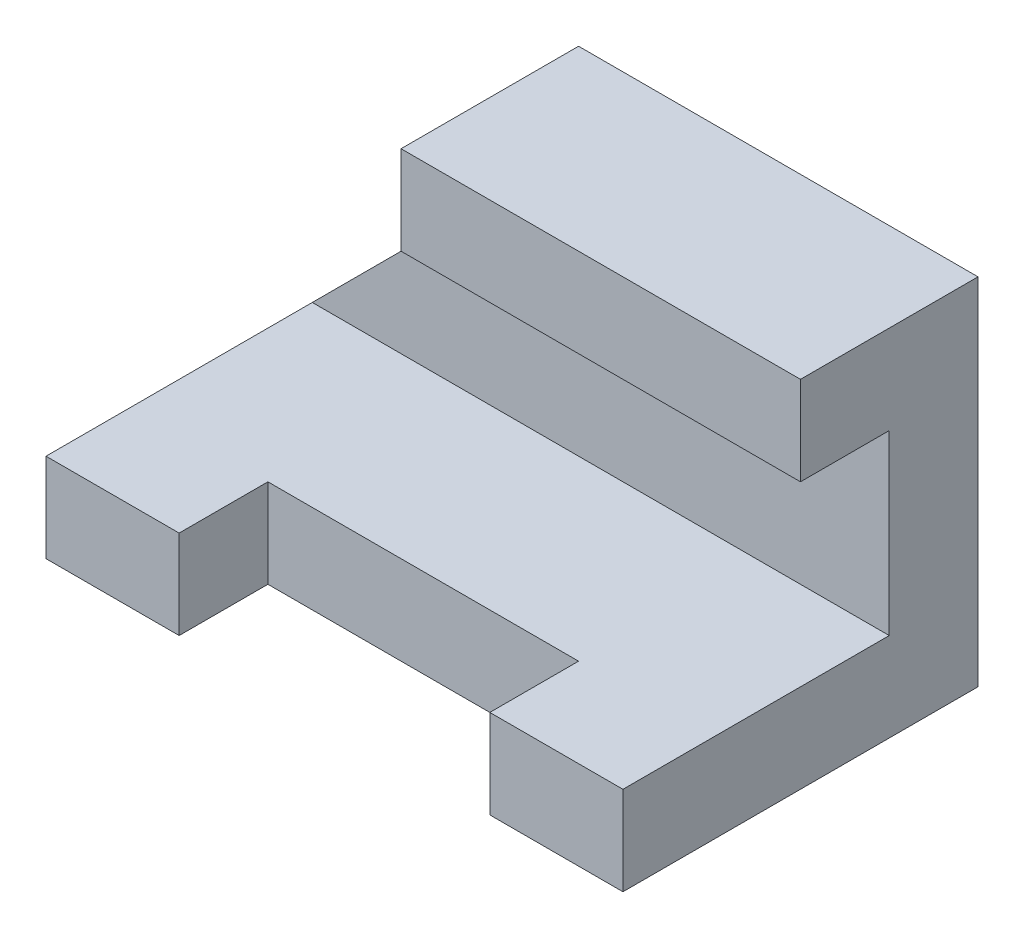
ISO-10303-21;
HEADER;
FILE_DESCRIPTION(('STEP AP214'),'2;1');
FILE_NAME('part.step','',(''),(''),'','','');
FILE_SCHEMA(('AUTOMOTIVE_DESIGN { 1 0 10303 214 1 1 1 1 }'));
ENDSEC;
DATA;
#1=APPLICATION_CONTEXT('core data for automotive mechanical design processes');
#2=APPLICATION_PROTOCOL_DEFINITION('international standard','automotive_design',2000,#1);
#3=PRODUCT_CONTEXT('',#1,'mechanical');
#4=PRODUCT('Part','Part','',(#3));
#5=PRODUCT_RELATED_PRODUCT_CATEGORY('part','',(#4));
#6=PRODUCT_DEFINITION_FORMATION('','',#4);
#7=PRODUCT_DEFINITION_CONTEXT('part definition',#1,'design');
#8=PRODUCT_DEFINITION('design','',#6,#7);
#9=PRODUCT_DEFINITION_SHAPE('','',#8);
#10=(LENGTH_UNIT() NAMED_UNIT(*) SI_UNIT(.MILLI.,.METRE.));
#11=(NAMED_UNIT(*) PLANE_ANGLE_UNIT() SI_UNIT($,.RADIAN.));
#12=(NAMED_UNIT(*) SI_UNIT($,.STERADIAN.) SOLID_ANGLE_UNIT());
#13=UNCERTAINTY_MEASURE_WITH_UNIT(LENGTH_MEASURE(1.E-05),#10,'distance_accuracy_value','');
#14=(GEOMETRIC_REPRESENTATION_CONTEXT(3) GLOBAL_UNCERTAINTY_ASSIGNED_CONTEXT((#13)) GLOBAL_UNIT_ASSIGNED_CONTEXT((#10,
#11,#12)) REPRESENTATION_CONTEXT('',''));
#15=CARTESIAN_POINT('',(0.,0.,0.));
#16=DIRECTION('',(0.,0.,1.));
#17=DIRECTION('',(1.,0.,0.));
#18=AXIS2_PLACEMENT_3D('',#15,#16,#17);
#19=CARTESIAN_POINT('',(0.,0.,8.));
#20=DIRECTION('',(0.,0.,1.));
#21=DIRECTION('',(1.,0.,0.));
#22=AXIS2_PLACEMENT_3D('',#19,#20,#21);
#23=PLANE('',#22);
#24=DIRECTION('',(0.,1.,0.));
#25=VECTOR('',#24,1.);
#26=CARTESIAN_POINT('',(3.,0.,8.));
#27=LINE('',#26,#25);
#28=CARTESIAN_POINT('',(3.,0.,8.));
#29=VERTEX_POINT('',#28);
#30=CARTESIAN_POINT('',(3.,2.,8.));
#31=VERTEX_POINT('',#30);
#32=EDGE_CURVE('E142',#29,#31,#27,.T.);
#33=ORIENTED_EDGE('',*,*,#32,.T.);
#34=DIRECTION('',(1.,0.,0.));
#35=VECTOR('',#34,1.);
#36=CARTESIAN_POINT('',(0.,2.,8.));
#37=LINE('',#36,#35);
#38=CARTESIAN_POINT('',(0.,2.,8.));
#39=VERTEX_POINT('',#38);
#40=EDGE_CURVE('E198',#39,#31,#37,.T.);
#41=ORIENTED_EDGE('',*,*,#40,.F.);
#42=DIRECTION('',(0.,-1.,0.));
#43=VECTOR('',#42,1.);
#44=CARTESIAN_POINT('',(0.,2.,8.));
#45=LINE('',#44,#43);
#46=CARTESIAN_POINT('',(0.,0.,8.));
#47=VERTEX_POINT('',#46);
#48=EDGE_CURVE('E158',#39,#47,#45,.T.);
#49=ORIENTED_EDGE('',*,*,#48,.T.);
#50=DIRECTION('',(1.,0.,0.));
#51=VECTOR('',#50,1.);
#52=CARTESIAN_POINT('',(0.,0.,8.));
#53=LINE('',#52,#51);
#54=EDGE_CURVE('E91',#47,#29,#53,.T.);
#55=ORIENTED_EDGE('',*,*,#54,.T.);
#56=EDGE_LOOP('',(#33,#41,#49,#55));
#57=FACE_BOUND('',#56,.T.);
#58=ADVANCED_FACE('F33',(#57),#23,.T.);
#59=CARTESIAN_POINT('',(0.,2.,8.));
#60=DIRECTION('',(1.,0.,0.));
#61=DIRECTION('',(0.,1.,0.));
#62=AXIS2_PLACEMENT_3D('',#59,#60,#61);
#63=PLANE('',#62);
#64=DIRECTION('',(0.,-1.,0.));
#65=VECTOR('',#64,1.);
#66=CARTESIAN_POINT('',(0.,2.,0.));
#67=LINE('',#66,#65);
#68=CARTESIAN_POINT('',(0.,2.,0.));
#69=VERTEX_POINT('',#68);
#70=CARTESIAN_POINT('',(0.,0.,0.));
#71=VERTEX_POINT('',#70);
#72=EDGE_CURVE('E168',#69,#71,#67,.T.);
#73=ORIENTED_EDGE('',*,*,#72,.T.);
#74=DIRECTION('',(0.,0.,-1.));
#75=VECTOR('',#74,1.);
#76=CARTESIAN_POINT('',(0.,0.,8.));
#77=LINE('',#76,#75);
#78=EDGE_CURVE('E195',#47,#71,#77,.T.);
#79=ORIENTED_EDGE('',*,*,#78,.F.);
#80=ORIENTED_EDGE('',*,*,#48,.F.);
#81=DIRECTION('',(0.,0.,-1.));
#82=VECTOR('',#81,1.);
#83=CARTESIAN_POINT('',(0.,2.,8.));
#84=LINE('',#83,#82);
#85=CARTESIAN_POINT('',(0.,2.,2.));
#86=VERTEX_POINT('',#85);
#87=EDGE_CURVE('E57',#39,#86,#84,.T.);
#88=ORIENTED_EDGE('',*,*,#87,.T.);
#89=EDGE_CURVE('E84',#86,#69,#84,.T.);
#90=ORIENTED_EDGE('',*,*,#89,.T.);
#91=EDGE_LOOP('',(#73,#79,#80,#88,#90));
#92=FACE_BOUND('',#91,.T.);
#93=ADVANCED_FACE('F35',(#92),#63,.F.);
#94=CARTESIAN_POINT('',(0.,0.,8.));
#95=DIRECTION('',(0.,1.,0.));
#96=DIRECTION('',(0.,0.,1.));
#97=AXIS2_PLACEMENT_3D('',#94,#95,#96);
#98=PLANE('',#97);
#99=DIRECTION('',(-1.,0.,0.));
#100=VECTOR('',#99,1.);
#101=CARTESIAN_POINT('',(3.,0.,6.));
#102=LINE('',#101,#100);
#103=CARTESIAN_POINT('',(10.,0.,6.));
#104=VERTEX_POINT('',#103);
#105=CARTESIAN_POINT('',(3.,0.,6.));
#106=VERTEX_POINT('',#105);
#107=EDGE_CURVE('E149',#104,#106,#102,.T.);
#108=ORIENTED_EDGE('',*,*,#107,.T.);
#109=DIRECTION('',(0.,0.,1.));
#110=VECTOR('',#109,1.);
#111=CARTESIAN_POINT('',(3.,0.,8.));
#112=LINE('',#111,#110);
#113=EDGE_CURVE('E144',#106,#29,#112,.T.);
#114=ORIENTED_EDGE('',*,*,#113,.T.);
#115=ORIENTED_EDGE('',*,*,#54,.F.);
#116=ORIENTED_EDGE('',*,*,#78,.T.);
#117=DIRECTION('',(1.,0.,0.));
#118=VECTOR('',#117,1.);
#119=CARTESIAN_POINT('',(0.,0.,0.));
#120=LINE('',#119,#118);
#121=CARTESIAN_POINT('',(13.,0.,0.));
#122=VERTEX_POINT('',#121);
#123=EDGE_CURVE('E170',#71,#122,#120,.T.);
#124=ORIENTED_EDGE('',*,*,#123,.T.);
#125=DIRECTION('',(0.,0.,-1.));
#126=VECTOR('',#125,1.);
#127=CARTESIAN_POINT('',(13.,0.,8.));
#128=LINE('',#127,#126);
#129=CARTESIAN_POINT('',(13.,0.,8.));
#130=VERTEX_POINT('',#129);
#131=EDGE_CURVE('E192',#130,#122,#128,.T.);
#132=ORIENTED_EDGE('',*,*,#131,.F.);
#133=CARTESIAN_POINT('',(10.,0.,8.));
#134=VERTEX_POINT('',#133);
#135=EDGE_CURVE('E161',#134,#130,#53,.T.);
#136=ORIENTED_EDGE('',*,*,#135,.F.);
#137=DIRECTION('',(0.,0.,-1.));
#138=VECTOR('',#137,1.);
#139=CARTESIAN_POINT('',(10.,0.,8.));
#140=LINE('',#139,#138);
#141=EDGE_CURVE('E154',#134,#104,#140,.T.);
#142=ORIENTED_EDGE('',*,*,#141,.T.);
#143=EDGE_LOOP('',(#108,#114,#115,#116,#124,#132,#136,#142));
#144=FACE_BOUND('',#143,.T.);
#145=ADVANCED_FACE('F151',(#144),#98,.F.);
#146=CARTESIAN_POINT('',(13.,0.,8.));
#147=DIRECTION('',(-1.,0.,0.));
#148=DIRECTION('',(0.,0.,1.));
#149=AXIS2_PLACEMENT_3D('',#146,#147,#148);
#150=PLANE('',#149);
#151=DIRECTION('',(0.,0.,-1.));
#152=VECTOR('',#151,1.);
#153=CARTESIAN_POINT('',(13.,8.,8.));
#154=LINE('',#153,#152);
#155=CARTESIAN_POINT('',(13.,8.,4.));
#156=VERTEX_POINT('',#155);
#157=CARTESIAN_POINT('',(13.,8.,0.));
#158=VERTEX_POINT('',#157);
#159=EDGE_CURVE('E190',#156,#158,#154,.T.);
#160=ORIENTED_EDGE('',*,*,#159,.F.);
#161=DIRECTION('',(0.,1.,0.));
#162=VECTOR('',#161,1.);
#163=CARTESIAN_POINT('',(13.,8.,4.));
#164=LINE('',#163,#162);
#165=CARTESIAN_POINT('',(13.,6.,4.));
#166=VERTEX_POINT('',#165);
#167=EDGE_CURVE('E228',#166,#156,#164,.T.);
#168=ORIENTED_EDGE('',*,*,#167,.F.);
#169=DIRECTION('',(0.,0.,1.));
#170=VECTOR('',#169,1.);
#171=CARTESIAN_POINT('',(13.,6.,4.));
#172=LINE('',#171,#170);
#173=CARTESIAN_POINT('',(13.,6.,2.));
#174=VERTEX_POINT('',#173);
#175=EDGE_CURVE('E231',#174,#166,#172,.T.);
#176=ORIENTED_EDGE('',*,*,#175,.F.);
#177=DIRECTION('',(0.,1.,0.));
#178=VECTOR('',#177,1.);
#179=CARTESIAN_POINT('',(13.,6.,2.));
#180=LINE('',#179,#178);
#181=CARTESIAN_POINT('',(13.,2.,2.));
#182=VERTEX_POINT('',#181);
#183=EDGE_CURVE('E236',#182,#174,#180,.T.);
#184=ORIENTED_EDGE('',*,*,#183,.F.);
#185=DIRECTION('',(0.,0.,-1.));
#186=VECTOR('',#185,1.);
#187=CARTESIAN_POINT('',(13.,2.,8.));
#188=LINE('',#187,#186);
#189=CARTESIAN_POINT('',(13.,2.,8.));
#190=VERTEX_POINT('',#189);
#191=EDGE_CURVE('E249',#190,#182,#188,.T.);
#192=ORIENTED_EDGE('',*,*,#191,.F.);
#193=DIRECTION('',(0.,1.,0.));
#194=VECTOR('',#193,1.);
#195=CARTESIAN_POINT('',(13.,0.,8.));
#196=LINE('',#195,#194);
#197=EDGE_CURVE('E160',#130,#190,#196,.T.);
#198=ORIENTED_EDGE('',*,*,#197,.F.);
#199=ORIENTED_EDGE('',*,*,#131,.T.);
#200=DIRECTION('',(0.,1.,0.));
#201=VECTOR('',#200,1.);
#202=CARTESIAN_POINT('',(13.,0.,0.));
#203=LINE('',#202,#201);
#204=EDGE_CURVE('E173',#122,#158,#203,.T.);
#205=ORIENTED_EDGE('',*,*,#204,.T.);
#206=EDGE_LOOP('',(#160,#168,#176,#184,#192,#198,#199,#205));
#207=FACE_BOUND('',#206,.T.);
#208=ADVANCED_FACE('F221',(#207),#150,.F.);
#209=CARTESIAN_POINT('',(13.,8.,8.));
#210=DIRECTION('',(0.,-1.,0.));
#211=DIRECTION('',(1.,0.,0.));
#212=AXIS2_PLACEMENT_3D('',#209,#210,#211);
#213=PLANE('',#212);
#214=DIRECTION('',(0.,0.,-1.));
#215=VECTOR('',#214,1.);
#216=CARTESIAN_POINT('',(4.,8.,8.));
#217=LINE('',#216,#215);
#218=CARTESIAN_POINT('',(4.,8.,4.));
#219=VERTEX_POINT('',#218);
#220=CARTESIAN_POINT('',(4.,8.,0.));
#221=VERTEX_POINT('',#220);
#222=EDGE_CURVE('E188',#219,#221,#217,.T.);
#223=ORIENTED_EDGE('',*,*,#222,.F.);
#224=DIRECTION('',(1.,0.,0.));
#225=VECTOR('',#224,1.);
#226=CARTESIAN_POINT('',(-5.,8.,4.));
#227=LINE('',#226,#225);
#228=EDGE_CURVE('E171',#219,#156,#227,.T.);
#229=ORIENTED_EDGE('',*,*,#228,.T.);
#230=ORIENTED_EDGE('',*,*,#159,.T.);
#231=DIRECTION('',(-1.,0.,0.));
#232=VECTOR('',#231,1.);
#233=CARTESIAN_POINT('',(13.,8.,0.));
#234=LINE('',#233,#232);
#235=EDGE_CURVE('E176',#158,#221,#234,.T.);
#236=ORIENTED_EDGE('',*,*,#235,.T.);
#237=EDGE_LOOP('',(#223,#229,#230,#236));
#238=FACE_BOUND('',#237,.T.);
#239=ADVANCED_FACE('F224',(#238),#213,.F.);
#240=CARTESIAN_POINT('',(4.,8.,8.));
#241=DIRECTION('',(1.,0.,0.));
#242=DIRECTION('',(0.,0.,-1.));
#243=AXIS2_PLACEMENT_3D('',#240,#241,#242);
#244=PLANE('',#243);
#245=DIRECTION('',(0.,0.,-1.));
#246=VECTOR('',#245,1.);
#247=CARTESIAN_POINT('',(4.,6.,8.));
#248=LINE('',#247,#246);
#249=CARTESIAN_POINT('',(4.,6.,4.));
#250=VERTEX_POINT('',#249);
#251=CARTESIAN_POINT('',(4.,6.,2.));
#252=VERTEX_POINT('',#251);
#253=EDGE_CURVE('E187',#250,#252,#248,.T.);
#254=ORIENTED_EDGE('',*,*,#253,.F.);
#255=DIRECTION('',(0.,1.,0.));
#256=VECTOR('',#255,1.);
#257=CARTESIAN_POINT('',(4.,8.,4.));
#258=LINE('',#257,#256);
#259=EDGE_CURVE('E11',#250,#219,#258,.T.);
#260=ORIENTED_EDGE('',*,*,#259,.T.);
#261=ORIENTED_EDGE('',*,*,#222,.T.);
#262=DIRECTION('',(0.,-1.,0.));
#263=VECTOR('',#262,1.);
#264=CARTESIAN_POINT('',(4.,8.,0.));
#265=LINE('',#264,#263);
#266=CARTESIAN_POINT('',(4.,6.,0.));
#267=VERTEX_POINT('',#266);
#268=EDGE_CURVE('E179',#221,#267,#265,.T.);
#269=ORIENTED_EDGE('',*,*,#268,.T.);
#270=EDGE_CURVE('E185',#252,#267,#248,.T.);
#271=ORIENTED_EDGE('',*,*,#270,.F.);
#272=EDGE_LOOP('',(#254,#260,#261,#269,#271));
#273=FACE_BOUND('',#272,.T.);
#274=ADVANCED_FACE('F207',(#273),#244,.F.);
#275=CARTESIAN_POINT('',(4.,6.,8.));
#276=DIRECTION('',(0.707106781186547,-0.707106781186548,0.));
#277=DIRECTION('',(0.707106781186548,0.707106781186547,0.));
#278=AXIS2_PLACEMENT_3D('',#275,#276,#277);
#279=PLANE('',#278);
#280=ORIENTED_EDGE('',*,*,#89,.F.);
#281=DIRECTION('',(0.707106781186548,0.707106781186547,0.));
#282=VECTOR('',#281,1.);
#283=CARTESIAN_POINT('',(4.,6.,2.));
#284=LINE('',#283,#282);
#285=EDGE_CURVE('E41',#86,#252,#284,.T.);
#286=ORIENTED_EDGE('',*,*,#285,.T.);
#287=ORIENTED_EDGE('',*,*,#270,.T.);
#288=DIRECTION('',(-0.707106781186548,-0.707106781186547,0.));
#289=VECTOR('',#288,1.);
#290=CARTESIAN_POINT('',(4.,6.,0.));
#291=LINE('',#290,#289);
#292=EDGE_CURVE('E182',#267,#69,#291,.T.);
#293=ORIENTED_EDGE('',*,*,#292,.T.);
#294=EDGE_LOOP('',(#280,#286,#287,#293));
#295=FACE_BOUND('',#294,.T.);
#296=ADVANCED_FACE('F202',(#295),#279,.F.);
#297=DIRECTION('',(0.,1.,0.));
#298=VECTOR('',#297,1.);
#299=CARTESIAN_POINT('',(10.,0.,8.));
#300=LINE('',#299,#298);
#301=CARTESIAN_POINT('',(10.,2.,8.));
#302=VERTEX_POINT('',#301);
#303=EDGE_CURVE('E48',#134,#302,#300,.T.);
#304=ORIENTED_EDGE('',*,*,#303,.F.);
#305=ORIENTED_EDGE('',*,*,#135,.T.);
#306=ORIENTED_EDGE('',*,*,#197,.T.);
#307=EDGE_CURVE('E197',#302,#190,#37,.T.);
#308=ORIENTED_EDGE('',*,*,#307,.F.);
#309=EDGE_LOOP('',(#304,#305,#306,#308));
#310=FACE_BOUND('',#309,.T.);
#311=ADVANCED_FACE('F266',(#310),#23,.T.);
#312=CARTESIAN_POINT('',(0.,0.,0.));
#313=DIRECTION('',(0.,0.,1.));
#314=DIRECTION('',(1.,0.,0.));
#315=AXIS2_PLACEMENT_3D('',#312,#313,#314);
#316=PLANE('',#315);
#317=ORIENTED_EDGE('',*,*,#72,.F.);
#318=ORIENTED_EDGE('',*,*,#292,.F.);
#319=ORIENTED_EDGE('',*,*,#268,.F.);
#320=ORIENTED_EDGE('',*,*,#235,.F.);
#321=ORIENTED_EDGE('',*,*,#204,.F.);
#322=ORIENTED_EDGE('',*,*,#123,.F.);
#323=EDGE_LOOP('',(#317,#318,#319,#320,#321,#322));
#324=FACE_BOUND('',#323,.T.);
#325=ADVANCED_FACE('F214',(#324),#316,.F.);
#326=CARTESIAN_POINT('',(-5.,8.,4.));
#327=DIRECTION('',(0.,0.,-1.));
#328=DIRECTION('',(-1.,0.,0.));
#329=AXIS2_PLACEMENT_3D('',#326,#327,#328);
#330=PLANE('',#329);
#331=DIRECTION('',(1.,0.,0.));
#332=VECTOR('',#331,1.);
#333=CARTESIAN_POINT('',(-5.,6.,4.));
#334=LINE('',#333,#332);
#335=EDGE_CURVE('E241',#250,#166,#334,.T.);
#336=ORIENTED_EDGE('',*,*,#335,.T.);
#337=ORIENTED_EDGE('',*,*,#167,.T.);
#338=ORIENTED_EDGE('',*,*,#228,.F.);
#339=ORIENTED_EDGE('',*,*,#259,.F.);
#340=EDGE_LOOP('',(#336,#337,#338,#339));
#341=FACE_BOUND('',#340,.T.);
#342=ADVANCED_FACE('F291',(#341),#330,.F.);
#343=CARTESIAN_POINT('',(-5.,6.,4.));
#344=DIRECTION('',(0.,1.,0.));
#345=DIRECTION('',(0.,0.,1.));
#346=AXIS2_PLACEMENT_3D('',#343,#344,#345);
#347=PLANE('',#346);
#348=DIRECTION('',(1.,0.,0.));
#349=VECTOR('',#348,1.);
#350=CARTESIAN_POINT('',(-5.,6.,2.));
#351=LINE('',#350,#349);
#352=EDGE_CURVE('E235',#252,#174,#351,.T.);
#353=ORIENTED_EDGE('',*,*,#352,.T.);
#354=ORIENTED_EDGE('',*,*,#175,.T.);
#355=ORIENTED_EDGE('',*,*,#335,.F.);
#356=ORIENTED_EDGE('',*,*,#253,.T.);
#357=EDGE_LOOP('',(#353,#354,#355,#356));
#358=FACE_BOUND('',#357,.T.);
#359=ADVANCED_FACE('F245',(#358),#347,.F.);
#360=CARTESIAN_POINT('',(-5.,6.,2.));
#361=DIRECTION('',(0.,0.,-1.));
#362=DIRECTION('',(0.,1.,0.));
#363=AXIS2_PLACEMENT_3D('',#360,#361,#362);
#364=PLANE('',#363);
#365=DIRECTION('',(1.,0.,0.));
#366=VECTOR('',#365,1.);
#367=CARTESIAN_POINT('',(-5.,2.,2.));
#368=LINE('',#367,#366);
#369=EDGE_CURVE('E233',#86,#182,#368,.T.);
#370=ORIENTED_EDGE('',*,*,#369,.T.);
#371=ORIENTED_EDGE('',*,*,#183,.T.);
#372=ORIENTED_EDGE('',*,*,#352,.F.);
#373=ORIENTED_EDGE('',*,*,#285,.F.);
#374=EDGE_LOOP('',(#370,#371,#372,#373));
#375=FACE_BOUND('',#374,.T.);
#376=ADVANCED_FACE('F247',(#375),#364,.F.);
#377=CARTESIAN_POINT('',(-5.,2.,8.));
#378=DIRECTION('',(0.,-1.,0.));
#379=DIRECTION('',(0.,0.,-1.));
#380=AXIS2_PLACEMENT_3D('',#377,#378,#379);
#381=PLANE('',#380);
#382=ORIENTED_EDGE('',*,*,#40,.T.);
#383=DIRECTION('',(0.,0.,1.));
#384=VECTOR('',#383,1.);
#385=CARTESIAN_POINT('',(3.,2.,8.));
#386=LINE('',#385,#384);
#387=CARTESIAN_POINT('',(3.,2.,6.));
#388=VERTEX_POINT('',#387);
#389=EDGE_CURVE('E147',#388,#31,#386,.T.);
#390=ORIENTED_EDGE('',*,*,#389,.F.);
#391=DIRECTION('',(-1.,0.,0.));
#392=VECTOR('',#391,1.);
#393=CARTESIAN_POINT('',(3.,2.,6.));
#394=LINE('',#393,#392);
#395=CARTESIAN_POINT('',(10.,2.,6.));
#396=VERTEX_POINT('',#395);
#397=EDGE_CURVE('E155',#396,#388,#394,.T.);
#398=ORIENTED_EDGE('',*,*,#397,.F.);
#399=DIRECTION('',(0.,0.,-1.));
#400=VECTOR('',#399,1.);
#401=CARTESIAN_POINT('',(10.,2.,8.));
#402=LINE('',#401,#400);
#403=EDGE_CURVE('E259',#302,#396,#402,.T.);
#404=ORIENTED_EDGE('',*,*,#403,.F.);
#405=ORIENTED_EDGE('',*,*,#307,.T.);
#406=ORIENTED_EDGE('',*,*,#191,.T.);
#407=ORIENTED_EDGE('',*,*,#369,.F.);
#408=ORIENTED_EDGE('',*,*,#87,.F.);
#409=EDGE_LOOP('',(#382,#390,#398,#404,#405,#406,#407,#408));
#410=FACE_BOUND('',#409,.T.);
#411=ADVANCED_FACE('F267',(#410),#381,.F.);
#412=CARTESIAN_POINT('',(3.,0.,8.));
#413=DIRECTION('',(-1.,0.,0.));
#414=DIRECTION('',(0.,0.,1.));
#415=AXIS2_PLACEMENT_3D('',#412,#413,#414);
#416=PLANE('',#415);
#417=ORIENTED_EDGE('',*,*,#389,.T.);
#418=ORIENTED_EDGE('',*,*,#32,.F.);
#419=ORIENTED_EDGE('',*,*,#113,.F.);
#420=DIRECTION('',(0.,1.,0.));
#421=VECTOR('',#420,1.);
#422=CARTESIAN_POINT('',(3.,0.,6.));
#423=LINE('',#422,#421);
#424=EDGE_CURVE('E250',#106,#388,#423,.T.);
#425=ORIENTED_EDGE('',*,*,#424,.T.);
#426=EDGE_LOOP('',(#417,#418,#419,#425));
#427=FACE_BOUND('',#426,.T.);
#428=ADVANCED_FACE('F143',(#427),#416,.F.);
#429=CARTESIAN_POINT('',(3.,0.,6.));
#430=DIRECTION('',(0.,0.,-1.));
#431=DIRECTION('',(-1.,0.,0.));
#432=AXIS2_PLACEMENT_3D('',#429,#430,#431);
#433=PLANE('',#432);
#434=ORIENTED_EDGE('',*,*,#397,.T.);
#435=ORIENTED_EDGE('',*,*,#424,.F.);
#436=ORIENTED_EDGE('',*,*,#107,.F.);
#437=DIRECTION('',(0.,1.,0.));
#438=VECTOR('',#437,1.);
#439=CARTESIAN_POINT('',(10.,0.,6.));
#440=LINE('',#439,#438);
#441=EDGE_CURVE('E254',#104,#396,#440,.T.);
#442=ORIENTED_EDGE('',*,*,#441,.T.);
#443=EDGE_LOOP('',(#434,#435,#436,#442));
#444=FACE_BOUND('',#443,.T.);
#445=ADVANCED_FACE('F270',(#444),#433,.F.);
#446=CARTESIAN_POINT('',(10.,0.,8.));
#447=DIRECTION('',(1.,0.,0.));
#448=DIRECTION('',(0.,0.,-1.));
#449=AXIS2_PLACEMENT_3D('',#446,#447,#448);
#450=PLANE('',#449);
#451=ORIENTED_EDGE('',*,*,#403,.T.);
#452=ORIENTED_EDGE('',*,*,#441,.F.);
#453=ORIENTED_EDGE('',*,*,#141,.F.);
#454=ORIENTED_EDGE('',*,*,#303,.T.);
#455=EDGE_LOOP('',(#451,#452,#453,#454));
#456=FACE_BOUND('',#455,.T.);
#457=ADVANCED_FACE('F263',(#456),#450,.F.);
#458=CLOSED_SHELL('',(#58,#93,#145,#208,#239,#274,#296,#311,#325,#342,#359,#376,#411,#428,#445,#457));
#459=MANIFOLD_SOLID_BREP('B2',#458);
#460=ADVANCED_BREP_SHAPE_REPRESENTATION('',(#18,#459),#14);
#461=SHAPE_DEFINITION_REPRESENTATION(#9,#460);
ENDSEC;
END-ISO-10303-21;
